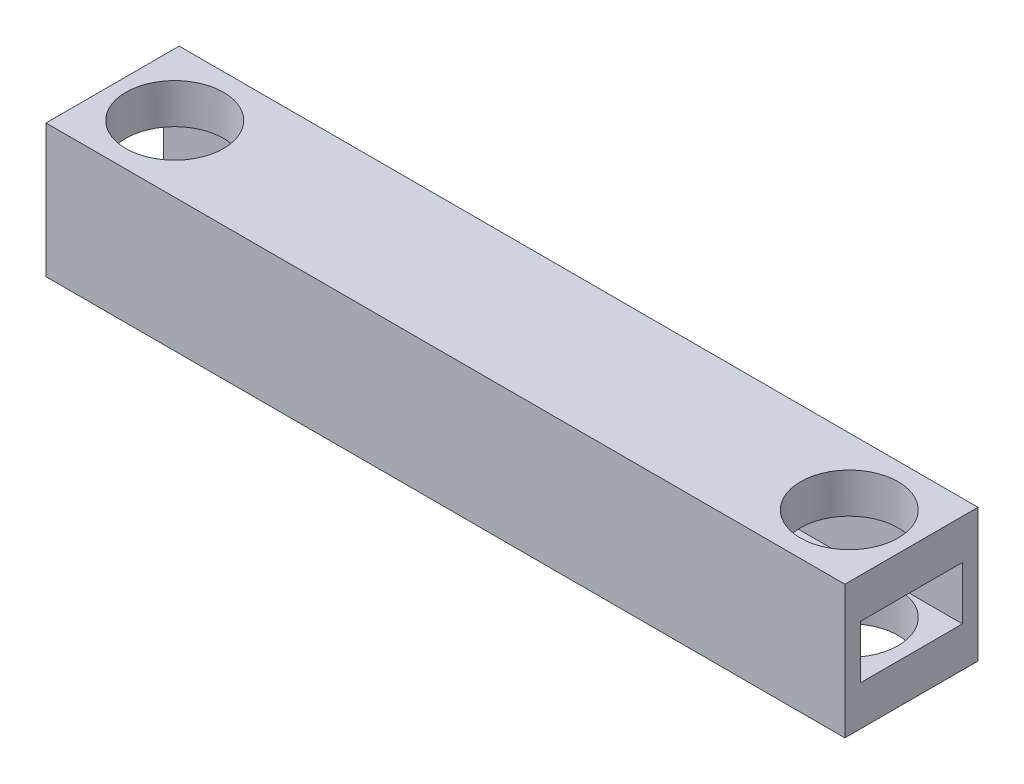
ISO-10303-21;
HEADER;
FILE_DESCRIPTION(('STEP AP214'),'2;1');
FILE_NAME('part.step','',(''),(''),'','','');
FILE_SCHEMA(('AUTOMOTIVE_DESIGN { 1 0 10303 214 1 1 1 1 }'));
ENDSEC;
DATA;
#1=APPLICATION_CONTEXT('core data for automotive mechanical design processes');
#2=APPLICATION_PROTOCOL_DEFINITION('international standard','automotive_design',2000,#1);
#3=PRODUCT_CONTEXT('',#1,'mechanical');
#4=PRODUCT('Part','Part','',(#3));
#5=PRODUCT_RELATED_PRODUCT_CATEGORY('part','',(#4));
#6=PRODUCT_DEFINITION_FORMATION('','',#4);
#7=PRODUCT_DEFINITION_CONTEXT('part definition',#1,'design');
#8=PRODUCT_DEFINITION('design','',#6,#7);
#9=PRODUCT_DEFINITION_SHAPE('','',#8);
#10=(LENGTH_UNIT() NAMED_UNIT(*) SI_UNIT(.MILLI.,.METRE.));
#11=(NAMED_UNIT(*) PLANE_ANGLE_UNIT() SI_UNIT($,.RADIAN.));
#12=(NAMED_UNIT(*) SI_UNIT($,.STERADIAN.) SOLID_ANGLE_UNIT());
#13=UNCERTAINTY_MEASURE_WITH_UNIT(LENGTH_MEASURE(1.E-05),#10,'distance_accuracy_value','');
#14=(GEOMETRIC_REPRESENTATION_CONTEXT(3) GLOBAL_UNCERTAINTY_ASSIGNED_CONTEXT((#13)) GLOBAL_UNIT_ASSIGNED_CONTEXT((#10,
#11,#12)) REPRESENTATION_CONTEXT('',''));
#15=CARTESIAN_POINT('',(0.,0.,0.));
#16=DIRECTION('',(0.,0.,1.));
#17=DIRECTION('',(1.,0.,0.));
#18=AXIS2_PLACEMENT_3D('',#15,#16,#17);
#19=CARTESIAN_POINT('',(-40.7159090909091,-10.4829545454545,15.));
#20=DIRECTION('',(0.,1.,0.));
#21=DIRECTION('',(0.,0.,1.));
#22=AXIS2_PLACEMENT_3D('',#19,#20,#21);
#23=CYLINDRICAL_SURFACE('',#22,11.);
#24=CARTESIAN_POINT('',(-40.7159090909091,10.5170454545455,15.));
#25=DIRECTION('',(0.,1.,0.));
#26=DIRECTION('',(0.,0.,1.));
#27=AXIS2_PLACEMENT_3D('',#24,#25,#26);
#28=CIRCLE('',#27,11.);
#29=CARTESIAN_POINT('',(-40.7159090909091,10.5170454545455,26.));
#30=VERTEX_POINT('',#29);
#31=EDGE_CURVE('E145',#30,#30,#28,.F.);
#32=ORIENTED_EDGE('',*,*,#31,.T.);
#33=EDGE_LOOP('',(#32));
#34=FACE_BOUND('',#33,.T.);
#35=CARTESIAN_POINT('',(-40.7159090909091,19.5170454545455,15.));
#36=DIRECTION('',(0.,-1.,0.));
#37=DIRECTION('',(0.,0.,-1.));
#38=AXIS2_PLACEMENT_3D('',#35,#36,#37);
#39=CIRCLE('',#38,11.);
#40=CARTESIAN_POINT('',(-40.7159090909091,19.5170454545455,4.));
#41=VERTEX_POINT('',#40);
#42=EDGE_CURVE('E144',#41,#41,#39,.T.);
#43=ORIENTED_EDGE('',*,*,#42,.F.);
#44=EDGE_LOOP('',(#43));
#45=FACE_BOUND('',#44,.T.);
#46=ADVANCED_FACE('F33',(#34,#45),#23,.F.);
#47=CARTESIAN_POINT('',(-54.7159090909091,19.5170454545455,30.));
#48=DIRECTION('',(1.,0.,0.));
#49=DIRECTION('',(0.,0.,-1.));
#50=AXIS2_PLACEMENT_3D('',#47,#48,#49);
#51=PLANE('',#50);
#52=DIRECTION('',(0.,0.,1.));
#53=VECTOR('',#52,1.);
#54=CARTESIAN_POINT('',(-54.7159090909091,-1.48295454545455,3.5));
#55=LINE('',#54,#53);
#56=CARTESIAN_POINT('',(-54.7159090909091,-1.48295454545454,3.5));
#57=VERTEX_POINT('',#56);
#58=CARTESIAN_POINT('',(-54.7159090909091,-1.48295454545455,26.5));
#59=VERTEX_POINT('',#58);
#60=EDGE_CURVE('E131',#57,#59,#55,.T.);
#61=ORIENTED_EDGE('',*,*,#60,.F.);
#62=DIRECTION('',(0.,-1.,0.));
#63=VECTOR('',#62,1.);
#64=CARTESIAN_POINT('',(-54.7159090909091,10.5170454545455,3.5));
#65=LINE('',#64,#63);
#66=CARTESIAN_POINT('',(-54.7159090909091,10.5170454545455,3.5));
#67=VERTEX_POINT('',#66);
#68=EDGE_CURVE('E50',#67,#57,#65,.T.);
#69=ORIENTED_EDGE('',*,*,#68,.F.);
#70=DIRECTION('',(0.,0.,-1.));
#71=VECTOR('',#70,1.);
#72=CARTESIAN_POINT('',(-54.7159090909091,10.5170454545455,3.5));
#73=LINE('',#72,#71);
#74=CARTESIAN_POINT('',(-54.7159090909091,10.5170454545455,26.5));
#75=VERTEX_POINT('',#74);
#76=EDGE_CURVE('E119',#75,#67,#73,.T.);
#77=ORIENTED_EDGE('',*,*,#76,.F.);
#78=DIRECTION('',(0.,1.,0.));
#79=VECTOR('',#78,1.);
#80=CARTESIAN_POINT('',(-54.7159090909091,10.5170454545455,26.5));
#81=LINE('',#80,#79);
#82=EDGE_CURVE('E122',#59,#75,#81,.T.);
#83=ORIENTED_EDGE('',*,*,#82,.F.);
#84=EDGE_LOOP('',(#61,#69,#77,#83));
#85=FACE_BOUND('',#84,.T.);
#86=DIRECTION('',(0.,-1.,0.));
#87=VECTOR('',#86,1.);
#88=CARTESIAN_POINT('',(-54.7159090909091,19.5170454545455,0.));
#89=LINE('',#88,#87);
#90=CARTESIAN_POINT('',(-54.7159090909091,19.5170454545455,0.));
#91=VERTEX_POINT('',#90);
#92=CARTESIAN_POINT('',(-54.7159090909091,-10.4829545454545,0.));
#93=VERTEX_POINT('',#92);
#94=EDGE_CURVE('E157',#91,#93,#89,.T.);
#95=ORIENTED_EDGE('',*,*,#94,.T.);
#96=DIRECTION('',(0.,0.,-1.));
#97=VECTOR('',#96,1.);
#98=CARTESIAN_POINT('',(-54.7159090909091,-10.4829545454545,30.));
#99=LINE('',#98,#97);
#100=CARTESIAN_POINT('',(-54.7159090909091,-10.4829545454545,30.));
#101=VERTEX_POINT('',#100);
#102=EDGE_CURVE('E11',#101,#93,#99,.T.);
#103=ORIENTED_EDGE('',*,*,#102,.F.);
#104=DIRECTION('',(0.,-1.,0.));
#105=VECTOR('',#104,1.);
#106=CARTESIAN_POINT('',(-54.7159090909091,19.5170454545455,30.));
#107=LINE('',#106,#105);
#108=CARTESIAN_POINT('',(-54.7159090909091,19.5170454545455,30.));
#109=VERTEX_POINT('',#108);
#110=EDGE_CURVE('E146',#109,#101,#107,.T.);
#111=ORIENTED_EDGE('',*,*,#110,.F.);
#112=DIRECTION('',(0.,0.,-1.));
#113=VECTOR('',#112,1.);
#114=CARTESIAN_POINT('',(-54.7159090909091,19.5170454545455,30.));
#115=LINE('',#114,#113);
#116=EDGE_CURVE('E156',#109,#91,#115,.T.);
#117=ORIENTED_EDGE('',*,*,#116,.T.);
#118=EDGE_LOOP('',(#95,#103,#111,#117));
#119=FACE_BOUND('',#118,.T.);
#120=ADVANCED_FACE('F35',(#85,#119),#51,.F.);
#121=CARTESIAN_POINT('',(-54.7159090909091,-10.4829545454545,30.));
#122=DIRECTION('',(0.,1.,0.));
#123=DIRECTION('',(0.,0.,1.));
#124=AXIS2_PLACEMENT_3D('',#121,#122,#123);
#125=PLANE('',#124);
#126=CARTESIAN_POINT('',(111.284090909091,-10.4829545454545,15.));
#127=DIRECTION('',(0.,1.,0.));
#128=DIRECTION('',(0.,0.,1.));
#129=AXIS2_PLACEMENT_3D('',#126,#127,#128);
#130=CIRCLE('',#129,11.);
#131=CARTESIAN_POINT('',(111.284090909091,-10.4829545454545,26.));
#132=VERTEX_POINT('',#131);
#133=EDGE_CURVE('E225',#132,#132,#130,.T.);
#134=ORIENTED_EDGE('',*,*,#133,.T.);
#135=EDGE_LOOP('',(#134));
#136=FACE_BOUND('',#135,.T.);
#137=CARTESIAN_POINT('',(-40.7159090909091,-10.4829545454545,15.));
#138=DIRECTION('',(0.,1.,0.));
#139=DIRECTION('',(0.,0.,1.));
#140=AXIS2_PLACEMENT_3D('',#137,#138,#139);
#141=CIRCLE('',#140,11.);
#142=CARTESIAN_POINT('',(-40.7159090909091,-10.4829545454545,26.));
#143=VERTEX_POINT('',#142);
#144=EDGE_CURVE('E141',#143,#143,#141,.T.);
#145=ORIENTED_EDGE('',*,*,#144,.T.);
#146=EDGE_LOOP('',(#145));
#147=FACE_BOUND('',#146,.T.);
#148=DIRECTION('',(1.,0.,0.));
#149=VECTOR('',#148,1.);
#150=CARTESIAN_POINT('',(-54.7159090909091,-10.4829545454545,0.));
#151=LINE('',#150,#149);
#152=CARTESIAN_POINT('',(125.284090909091,-10.4829545454545,0.));
#153=VERTEX_POINT('',#152);
#154=EDGE_CURVE('E160',#93,#153,#151,.T.);
#155=ORIENTED_EDGE('',*,*,#154,.T.);
#156=DIRECTION('',(0.,0.,-1.));
#157=VECTOR('',#156,1.);
#158=CARTESIAN_POINT('',(125.284090909091,-10.4829545454545,30.));
#159=LINE('',#158,#157);
#160=CARTESIAN_POINT('',(125.284090909091,-10.4829545454545,30.));
#161=VERTEX_POINT('',#160);
#162=EDGE_CURVE('E42',#161,#153,#159,.T.);
#163=ORIENTED_EDGE('',*,*,#162,.F.);
#164=DIRECTION('',(1.,0.,0.));
#165=VECTOR('',#164,1.);
#166=CARTESIAN_POINT('',(-54.7159090909091,-10.4829545454545,30.));
#167=LINE('',#166,#165);
#168=EDGE_CURVE('E149',#101,#161,#167,.T.);
#169=ORIENTED_EDGE('',*,*,#168,.F.);
#170=ORIENTED_EDGE('',*,*,#102,.T.);
#171=EDGE_LOOP('',(#155,#163,#169,#170));
#172=FACE_BOUND('',#171,.T.);
#173=ADVANCED_FACE('F202',(#136,#147,#172),#125,.F.);
#174=CARTESIAN_POINT('',(125.284090909091,19.5170454545455,30.));
#175=DIRECTION('',(-1.,0.,0.));
#176=DIRECTION('',(0.,0.,1.));
#177=AXIS2_PLACEMENT_3D('',#174,#175,#176);
#178=PLANE('',#177);
#179=DIRECTION('',(0.,0.,-1.));
#180=VECTOR('',#179,1.);
#181=CARTESIAN_POINT('',(125.284090909091,10.5170454545455,3.5));
#182=LINE('',#181,#180);
#183=CARTESIAN_POINT('',(125.284090909091,10.5170454545455,26.5));
#184=VERTEX_POINT('',#183);
#185=CARTESIAN_POINT('',(125.284090909091,10.5170454545455,3.5));
#186=VERTEX_POINT('',#185);
#187=EDGE_CURVE('E108',#184,#186,#182,.T.);
#188=ORIENTED_EDGE('',*,*,#187,.T.);
#189=DIRECTION('',(0.,-1.,0.));
#190=VECTOR('',#189,1.);
#191=CARTESIAN_POINT('',(125.284090909091,10.5170454545455,3.5));
#192=LINE('',#191,#190);
#193=CARTESIAN_POINT('',(125.284090909091,-1.48295454545455,3.5));
#194=VERTEX_POINT('',#193);
#195=EDGE_CURVE('E102',#186,#194,#192,.T.);
#196=ORIENTED_EDGE('',*,*,#195,.T.);
#197=DIRECTION('',(0.,0.,1.));
#198=VECTOR('',#197,1.);
#199=CARTESIAN_POINT('',(125.284090909091,-1.48295454545455,3.5));
#200=LINE('',#199,#198);
#201=CARTESIAN_POINT('',(125.284090909091,-1.48295454545454,26.5));
#202=VERTEX_POINT('',#201);
#203=EDGE_CURVE('E111',#194,#202,#200,.T.);
#204=ORIENTED_EDGE('',*,*,#203,.T.);
#205=DIRECTION('',(0.,1.,0.));
#206=VECTOR('',#205,1.);
#207=CARTESIAN_POINT('',(125.284090909091,10.5170454545455,26.5));
#208=LINE('',#207,#206);
#209=EDGE_CURVE('E58',#202,#184,#208,.T.);
#210=ORIENTED_EDGE('',*,*,#209,.T.);
#211=EDGE_LOOP('',(#188,#196,#204,#210));
#212=FACE_BOUND('',#211,.T.);
#213=DIRECTION('',(0.,1.,0.));
#214=VECTOR('',#213,1.);
#215=CARTESIAN_POINT('',(125.284090909091,19.5170454545455,0.));
#216=LINE('',#215,#214);
#217=CARTESIAN_POINT('',(125.284090909091,19.5170454545455,0.));
#218=VERTEX_POINT('',#217);
#219=EDGE_CURVE('E162',#153,#218,#216,.T.);
#220=ORIENTED_EDGE('',*,*,#219,.T.);
#221=DIRECTION('',(0.,0.,-1.));
#222=VECTOR('',#221,1.);
#223=CARTESIAN_POINT('',(125.284090909091,19.5170454545455,30.));
#224=LINE('',#223,#222);
#225=CARTESIAN_POINT('',(125.284090909091,19.5170454545455,30.));
#226=VERTEX_POINT('',#225);
#227=EDGE_CURVE('E167',#226,#218,#224,.T.);
#228=ORIENTED_EDGE('',*,*,#227,.F.);
#229=DIRECTION('',(0.,1.,0.));
#230=VECTOR('',#229,1.);
#231=CARTESIAN_POINT('',(125.284090909091,19.5170454545455,30.));
#232=LINE('',#231,#230);
#233=EDGE_CURVE('E152',#161,#226,#232,.T.);
#234=ORIENTED_EDGE('',*,*,#233,.F.);
#235=ORIENTED_EDGE('',*,*,#162,.T.);
#236=EDGE_LOOP('',(#220,#228,#234,#235));
#237=FACE_BOUND('',#236,.T.);
#238=ADVANCED_FACE('F116',(#212,#237),#178,.F.);
#239=CARTESIAN_POINT('',(-54.7159090909091,19.5170454545455,30.));
#240=DIRECTION('',(0.,-1.,0.));
#241=DIRECTION('',(0.,0.,-1.));
#242=AXIS2_PLACEMENT_3D('',#239,#240,#241);
#243=PLANE('',#242);
#244=CARTESIAN_POINT('',(111.284090909091,19.5170454545455,15.));
#245=DIRECTION('',(0.,-1.,0.));
#246=DIRECTION('',(0.,0.,-1.));
#247=AXIS2_PLACEMENT_3D('',#244,#245,#246);
#248=CIRCLE('',#247,11.);
#249=CARTESIAN_POINT('',(111.284090909091,19.5170454545455,3.99999999999999));
#250=VERTEX_POINT('',#249);
#251=EDGE_CURVE('E125',#250,#250,#248,.T.);
#252=ORIENTED_EDGE('',*,*,#251,.T.);
#253=EDGE_LOOP('',(#252));
#254=FACE_BOUND('',#253,.T.);
#255=ORIENTED_EDGE('',*,*,#42,.T.);
#256=EDGE_LOOP('',(#255));
#257=FACE_BOUND('',#256,.T.);
#258=DIRECTION('',(-1.,0.,0.));
#259=VECTOR('',#258,1.);
#260=CARTESIAN_POINT('',(-54.7159090909091,19.5170454545455,0.));
#261=LINE('',#260,#259);
#262=EDGE_CURVE('E150',#218,#91,#261,.T.);
#263=ORIENTED_EDGE('',*,*,#262,.T.);
#264=ORIENTED_EDGE('',*,*,#116,.F.);
#265=DIRECTION('',(-1.,0.,0.));
#266=VECTOR('',#265,1.);
#267=CARTESIAN_POINT('',(-54.7159090909091,19.5170454545455,30.));
#268=LINE('',#267,#266);
#269=EDGE_CURVE('E154',#226,#109,#268,.T.);
#270=ORIENTED_EDGE('',*,*,#269,.F.);
#271=ORIENTED_EDGE('',*,*,#227,.T.);
#272=EDGE_LOOP('',(#263,#264,#270,#271));
#273=FACE_BOUND('',#272,.T.);
#274=ADVANCED_FACE('F209',(#254,#257,#273),#243,.F.);
#275=CARTESIAN_POINT('',(0.,0.,30.));
#276=DIRECTION('',(0.,0.,1.));
#277=DIRECTION('',(1.,0.,0.));
#278=AXIS2_PLACEMENT_3D('',#275,#276,#277);
#279=PLANE('',#278);
#280=ORIENTED_EDGE('',*,*,#110,.T.);
#281=ORIENTED_EDGE('',*,*,#168,.T.);
#282=ORIENTED_EDGE('',*,*,#233,.T.);
#283=ORIENTED_EDGE('',*,*,#269,.T.);
#284=EDGE_LOOP('',(#280,#281,#282,#283));
#285=FACE_BOUND('',#284,.T.);
#286=ADVANCED_FACE('F206',(#285),#279,.T.);
#287=CARTESIAN_POINT('',(0.,0.,0.));
#288=DIRECTION('',(0.,0.,1.));
#289=DIRECTION('',(1.,0.,0.));
#290=AXIS2_PLACEMENT_3D('',#287,#288,#289);
#291=PLANE('',#290);
#292=ORIENTED_EDGE('',*,*,#94,.F.);
#293=ORIENTED_EDGE('',*,*,#262,.F.);
#294=ORIENTED_EDGE('',*,*,#219,.F.);
#295=ORIENTED_EDGE('',*,*,#154,.F.);
#296=EDGE_LOOP('',(#292,#293,#294,#295));
#297=FACE_BOUND('',#296,.T.);
#298=ADVANCED_FACE('F191',(#297),#291,.F.);
#299=CARTESIAN_POINT('',(-40.7159090909091,-1.48295454545455,15.));
#300=DIRECTION('',(0.,-1.,0.));
#301=DIRECTION('',(0.,0.,-1.));
#302=AXIS2_PLACEMENT_3D('',#299,#300,#301);
#303=CIRCLE('',#302,11.);
#304=CARTESIAN_POINT('',(-40.7159090909091,-1.48295454545455,4.));
#305=VERTEX_POINT('',#304);
#306=EDGE_CURVE('E137',#305,#305,#303,.F.);
#307=ORIENTED_EDGE('',*,*,#306,.T.);
#308=EDGE_LOOP('',(#307));
#309=FACE_BOUND('',#308,.T.);
#310=ORIENTED_EDGE('',*,*,#144,.F.);
#311=EDGE_LOOP('',(#310));
#312=FACE_BOUND('',#311,.T.);
#313=ADVANCED_FACE('F182',(#309,#312),#23,.F.);
#314=CARTESIAN_POINT('',(125.284090909091,10.5170454545455,3.5));
#315=DIRECTION('',(0.,1.,0.));
#316=DIRECTION('',(0.,0.,1.));
#317=AXIS2_PLACEMENT_3D('',#314,#315,#316);
#318=PLANE('',#317);
#319=CARTESIAN_POINT('',(111.284090909091,10.5170454545455,15.));
#320=DIRECTION('',(0.,1.,0.));
#321=DIRECTION('',(0.,0.,1.));
#322=AXIS2_PLACEMENT_3D('',#319,#320,#321);
#323=CIRCLE('',#322,11.);
#324=CARTESIAN_POINT('',(111.284090909091,10.5170454545455,26.));
#325=VERTEX_POINT('',#324);
#326=EDGE_CURVE('E244',#325,#325,#323,.T.);
#327=ORIENTED_EDGE('',*,*,#326,.T.);
#328=EDGE_LOOP('',(#327));
#329=FACE_BOUND('',#328,.T.);
#330=ORIENTED_EDGE('',*,*,#76,.T.);
#331=DIRECTION('',(-1.,0.,0.));
#332=VECTOR('',#331,1.);
#333=CARTESIAN_POINT('',(125.284090909091,10.5170454545455,3.5));
#334=LINE('',#333,#332);
#335=EDGE_CURVE('E135',#186,#67,#334,.T.);
#336=ORIENTED_EDGE('',*,*,#335,.F.);
#337=ORIENTED_EDGE('',*,*,#187,.F.);
#338=DIRECTION('',(-1.,0.,0.));
#339=VECTOR('',#338,1.);
#340=CARTESIAN_POINT('',(125.284090909091,10.5170454545455,26.5));
#341=LINE('',#340,#339);
#342=EDGE_CURVE('E138',#184,#75,#341,.T.);
#343=ORIENTED_EDGE('',*,*,#342,.T.);
#344=EDGE_LOOP('',(#330,#336,#337,#343));
#345=FACE_BOUND('',#344,.T.);
#346=ORIENTED_EDGE('',*,*,#31,.F.);
#347=EDGE_LOOP('',(#346));
#348=FACE_BOUND('',#347,.T.);
#349=ADVANCED_FACE('F180',(#329,#345,#348),#318,.F.);
#350=CARTESIAN_POINT('',(125.284090909091,-1.48295454545455,3.5));
#351=DIRECTION('',(0.,-1.,0.));
#352=DIRECTION('',(0.,0.,-1.));
#353=AXIS2_PLACEMENT_3D('',#350,#351,#352);
#354=PLANE('',#353);
#355=CARTESIAN_POINT('',(111.284090909091,-1.48295454545455,15.));
#356=DIRECTION('',(0.,-1.,0.));
#357=DIRECTION('',(0.,0.,-1.));
#358=AXIS2_PLACEMENT_3D('',#355,#356,#357);
#359=CIRCLE('',#358,11.);
#360=CARTESIAN_POINT('',(111.284090909091,-1.48295454545455,3.99999999999999));
#361=VERTEX_POINT('',#360);
#362=EDGE_CURVE('E37',#361,#361,#359,.T.);
#363=ORIENTED_EDGE('',*,*,#362,.T.);
#364=EDGE_LOOP('',(#363));
#365=FACE_BOUND('',#364,.T.);
#366=ORIENTED_EDGE('',*,*,#60,.T.);
#367=DIRECTION('',(-1.,0.,0.));
#368=VECTOR('',#367,1.);
#369=CARTESIAN_POINT('',(125.284090909091,-1.48295454545455,26.5));
#370=LINE('',#369,#368);
#371=EDGE_CURVE('E107',#202,#59,#370,.T.);
#372=ORIENTED_EDGE('',*,*,#371,.F.);
#373=ORIENTED_EDGE('',*,*,#203,.F.);
#374=DIRECTION('',(-1.,0.,0.));
#375=VECTOR('',#374,1.);
#376=CARTESIAN_POINT('',(125.284090909091,-1.48295454545455,3.5));
#377=LINE('',#376,#375);
#378=EDGE_CURVE('E98',#194,#57,#377,.T.);
#379=ORIENTED_EDGE('',*,*,#378,.T.);
#380=EDGE_LOOP('',(#366,#372,#373,#379));
#381=FACE_BOUND('',#380,.T.);
#382=ORIENTED_EDGE('',*,*,#306,.F.);
#383=EDGE_LOOP('',(#382));
#384=FACE_BOUND('',#383,.T.);
#385=ADVANCED_FACE('F112',(#365,#381,#384),#354,.F.);
#386=CARTESIAN_POINT('',(125.284090909091,10.5170454545455,3.5));
#387=DIRECTION('',(0.,0.,-1.));
#388=DIRECTION('',(0.,1.,0.));
#389=AXIS2_PLACEMENT_3D('',#386,#387,#388);
#390=PLANE('',#389);
#391=ORIENTED_EDGE('',*,*,#68,.T.);
#392=ORIENTED_EDGE('',*,*,#378,.F.);
#393=ORIENTED_EDGE('',*,*,#195,.F.);
#394=ORIENTED_EDGE('',*,*,#335,.T.);
#395=EDGE_LOOP('',(#391,#392,#393,#394));
#396=FACE_BOUND('',#395,.T.);
#397=ADVANCED_FACE('F100',(#396),#390,.F.);
#398=CARTESIAN_POINT('',(125.284090909091,10.5170454545455,26.5));
#399=DIRECTION('',(0.,0.,1.));
#400=DIRECTION('',(0.,-1.,0.));
#401=AXIS2_PLACEMENT_3D('',#398,#399,#400);
#402=PLANE('',#401);
#403=ORIENTED_EDGE('',*,*,#82,.T.);
#404=ORIENTED_EDGE('',*,*,#342,.F.);
#405=ORIENTED_EDGE('',*,*,#209,.F.);
#406=ORIENTED_EDGE('',*,*,#371,.T.);
#407=EDGE_LOOP('',(#403,#404,#405,#406));
#408=FACE_BOUND('',#407,.T.);
#409=ADVANCED_FACE('F257',(#408),#402,.F.);
#410=CARTESIAN_POINT('',(111.284090909091,-10.4829545454545,15.));
#411=DIRECTION('',(0.,1.,0.));
#412=DIRECTION('',(0.,0.,1.));
#413=AXIS2_PLACEMENT_3D('',#410,#411,#412);
#414=CYLINDRICAL_SURFACE('',#413,11.);
#415=ORIENTED_EDGE('',*,*,#133,.F.);
#416=EDGE_LOOP('',(#415));
#417=FACE_BOUND('',#416,.T.);
#418=ORIENTED_EDGE('',*,*,#362,.F.);
#419=EDGE_LOOP('',(#418));
#420=FACE_BOUND('',#419,.T.);
#421=ADVANCED_FACE('F252',(#417,#420),#414,.F.);
#422=ORIENTED_EDGE('',*,*,#326,.F.);
#423=EDGE_LOOP('',(#422));
#424=FACE_BOUND('',#423,.T.);
#425=ORIENTED_EDGE('',*,*,#251,.F.);
#426=EDGE_LOOP('',(#425));
#427=FACE_BOUND('',#426,.T.);
#428=ADVANCED_FACE('F250',(#424,#427),#414,.F.);
#429=CLOSED_SHELL('',(#46,#120,#173,#238,#274,#286,#298,#313,#349,#385,#397,#409,#421,#428));
#430=MANIFOLD_SOLID_BREP('B2',#429);
#431=ADVANCED_BREP_SHAPE_REPRESENTATION('',(#18,#430),#14);
#432=SHAPE_DEFINITION_REPRESENTATION(#9,#431);
ENDSEC;
END-ISO-10303-21;
